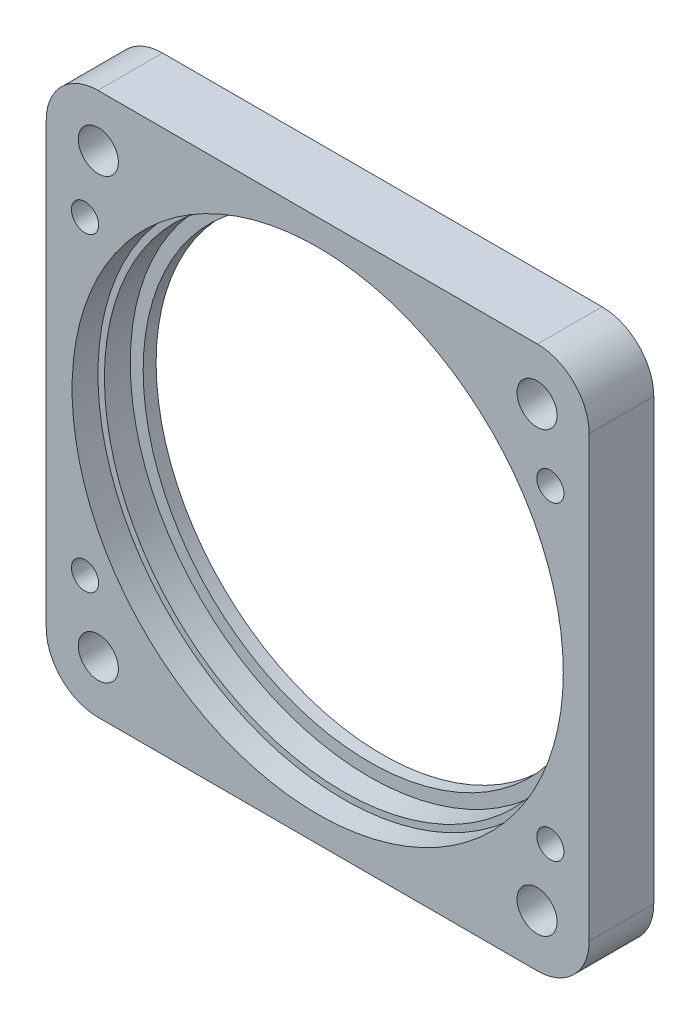
ISO-10303-21;
HEADER;
FILE_DESCRIPTION(('STEP AP214'),'2;1');
FILE_NAME('part.step','',(''),(''),'','','');
FILE_SCHEMA(('AUTOMOTIVE_DESIGN { 1 0 10303 214 1 1 1 1 }'));
ENDSEC;
DATA;
#1=APPLICATION_CONTEXT('core data for automotive mechanical design processes');
#2=APPLICATION_PROTOCOL_DEFINITION('international standard','automotive_design',2000,#1);
#3=PRODUCT_CONTEXT('',#1,'mechanical');
#4=PRODUCT('Part','Part','',(#3));
#5=PRODUCT_RELATED_PRODUCT_CATEGORY('part','',(#4));
#6=PRODUCT_DEFINITION_FORMATION('','',#4);
#7=PRODUCT_DEFINITION_CONTEXT('part definition',#1,'design');
#8=PRODUCT_DEFINITION('design','',#6,#7);
#9=PRODUCT_DEFINITION_SHAPE('','',#8);
#10=(LENGTH_UNIT() NAMED_UNIT(*) SI_UNIT(.MILLI.,.METRE.));
#11=(NAMED_UNIT(*) PLANE_ANGLE_UNIT() SI_UNIT($,.RADIAN.));
#12=(NAMED_UNIT(*) SI_UNIT($,.STERADIAN.) SOLID_ANGLE_UNIT());
#13=UNCERTAINTY_MEASURE_WITH_UNIT(LENGTH_MEASURE(1.E-05),#10,'distance_accuracy_value','');
#14=(GEOMETRIC_REPRESENTATION_CONTEXT(3) GLOBAL_UNCERTAINTY_ASSIGNED_CONTEXT((#13)) GLOBAL_UNIT_ASSIGNED_CONTEXT((#10,
#11,#12)) REPRESENTATION_CONTEXT('',''));
#15=CARTESIAN_POINT('',(0.,0.,0.));
#16=DIRECTION('',(0.,0.,1.));
#17=DIRECTION('',(1.,0.,0.));
#18=AXIS2_PLACEMENT_3D('',#15,#16,#17);
#19=CARTESIAN_POINT('',(18.,12.,5.));
#20=DIRECTION('',(0.,0.,-1.));
#21=DIRECTION('',(-1.,0.,0.));
#22=AXIS2_PLACEMENT_3D('',#19,#20,#21);
#23=CYLINDRICAL_SURFACE('',#22,1.05);
#24=CARTESIAN_POINT('',(18.,12.,5.));
#25=DIRECTION('',(0.,0.,-1.));
#26=DIRECTION('',(-1.,0.,0.));
#27=AXIS2_PLACEMENT_3D('',#24,#25,#26);
#28=CIRCLE('',#27,1.05);
#29=CARTESIAN_POINT('',(16.95,12.,5.));
#30=VERTEX_POINT('',#29);
#31=EDGE_CURVE('E199',#30,#30,#28,.T.);
#32=ORIENTED_EDGE('',*,*,#31,.F.);
#33=EDGE_LOOP('',(#32));
#34=FACE_BOUND('',#33,.T.);
#35=CARTESIAN_POINT('',(18.,12.,3.));
#36=DIRECTION('',(0.,0.,-1.));
#37=DIRECTION('',(-1.,0.,0.));
#38=AXIS2_PLACEMENT_3D('',#35,#36,#37);
#39=CIRCLE('',#38,1.05);
#40=CARTESIAN_POINT('',(16.95,12.,3.));
#41=VERTEX_POINT('',#40);
#42=EDGE_CURVE('E46',#41,#41,#39,.F.);
#43=ORIENTED_EDGE('',*,*,#42,.F.);
#44=EDGE_LOOP('',(#43));
#45=FACE_BOUND('',#44,.T.);
#46=ADVANCED_FACE('F42',(#34,#45),#23,.F.);
#47=CARTESIAN_POINT('',(-18.,-12.,5.));
#48=DIRECTION('',(0.,0.,-1.));
#49=DIRECTION('',(-1.,0.,0.));
#50=AXIS2_PLACEMENT_3D('',#47,#48,#49);
#51=CYLINDRICAL_SURFACE('',#50,1.05);
#52=CARTESIAN_POINT('',(-18.,-12.,5.));
#53=DIRECTION('',(0.,0.,-1.));
#54=DIRECTION('',(-1.,0.,0.));
#55=AXIS2_PLACEMENT_3D('',#52,#53,#54);
#56=CIRCLE('',#55,1.05);
#57=CARTESIAN_POINT('',(-19.05,-12.,5.));
#58=VERTEX_POINT('',#57);
#59=EDGE_CURVE('E190',#58,#58,#56,.T.);
#60=ORIENTED_EDGE('',*,*,#59,.F.);
#61=EDGE_LOOP('',(#60));
#62=FACE_BOUND('',#61,.T.);
#63=CARTESIAN_POINT('',(-18.,-12.,3.));
#64=DIRECTION('',(0.,0.,-1.));
#65=DIRECTION('',(-1.,0.,0.));
#66=AXIS2_PLACEMENT_3D('',#63,#64,#65);
#67=CIRCLE('',#66,1.05);
#68=CARTESIAN_POINT('',(-19.05,-12.,3.));
#69=VERTEX_POINT('',#68);
#70=EDGE_CURVE('E178',#69,#69,#67,.F.);
#71=ORIENTED_EDGE('',*,*,#70,.F.);
#72=EDGE_LOOP('',(#71));
#73=FACE_BOUND('',#72,.T.);
#74=ADVANCED_FACE('F262',(#62,#73),#51,.F.);
#75=CARTESIAN_POINT('',(0.,0.,-52.3259018078045));
#76=DIRECTION('',(0.,0.,1.));
#77=DIRECTION('',(1.,0.,0.));
#78=AXIS2_PLACEMENT_3D('',#75,#76,#77);
#79=CYLINDRICAL_SURFACE('',#78,18.5);
#80=CARTESIAN_POINT('',(0.,0.,1.));
#81=DIRECTION('',(0.,0.,1.));
#82=DIRECTION('',(1.,0.,0.));
#83=AXIS2_PLACEMENT_3D('',#80,#81,#82);
#84=CIRCLE('',#83,18.5);
#85=CARTESIAN_POINT('',(18.5,0.,1.));
#86=VERTEX_POINT('',#85);
#87=EDGE_CURVE('E149',#86,#86,#84,.F.);
#88=ORIENTED_EDGE('',*,*,#87,.T.);
#89=EDGE_LOOP('',(#88));
#90=FACE_BOUND('',#89,.T.);
#91=CARTESIAN_POINT('',(0.,0.,3.));
#92=DIRECTION('',(0.,0.,1.));
#93=DIRECTION('',(1.,0.,0.));
#94=AXIS2_PLACEMENT_3D('',#91,#92,#93);
#95=CIRCLE('',#94,18.5);
#96=CARTESIAN_POINT('',(18.5,0.,3.));
#97=VERTEX_POINT('',#96);
#98=EDGE_CURVE('E150',#97,#97,#95,.F.);
#99=ORIENTED_EDGE('',*,*,#98,.F.);
#100=EDGE_LOOP('',(#99));
#101=FACE_BOUND('',#100,.T.);
#102=ADVANCED_FACE('F268',(#90,#101),#79,.F.);
#103=CARTESIAN_POINT('',(0.,0.,0.));
#104=DIRECTION('',(0.,0.,1.));
#105=DIRECTION('',(1.,0.,0.));
#106=AXIS2_PLACEMENT_3D('',#103,#104,#105);
#107=CYLINDRICAL_SURFACE('',#106,17.5);
#108=CARTESIAN_POINT('',(0.,0.,0.));
#109=DIRECTION('',(0.,0.,1.));
#110=DIRECTION('',(1.,0.,0.));
#111=AXIS2_PLACEMENT_3D('',#108,#109,#110);
#112=CIRCLE('',#111,17.5);
#113=CARTESIAN_POINT('',(17.5,0.,0.));
#114=VERTEX_POINT('',#113);
#115=EDGE_CURVE('E148',#114,#114,#112,.T.);
#116=ORIENTED_EDGE('',*,*,#115,.F.);
#117=EDGE_LOOP('',(#116));
#118=FACE_BOUND('',#117,.T.);
#119=CARTESIAN_POINT('',(0.,0.,1.));
#120=DIRECTION('',(0.,0.,1.));
#121=DIRECTION('',(1.,0.,0.));
#122=AXIS2_PLACEMENT_3D('',#119,#120,#121);
#123=CIRCLE('',#122,17.5);
#124=CARTESIAN_POINT('',(17.5,0.,1.));
#125=VERTEX_POINT('',#124);
#126=EDGE_CURVE('E145',#125,#125,#123,.F.);
#127=ORIENTED_EDGE('',*,*,#126,.F.);
#128=EDGE_LOOP('',(#127));
#129=FACE_BOUND('',#128,.T.);
#130=ADVANCED_FACE('F307',(#118,#129),#107,.F.);
#131=CARTESIAN_POINT('',(21.,21.,5.));
#132=DIRECTION('',(-1.,0.,0.));
#133=DIRECTION('',(0.,-1.,0.));
#134=AXIS2_PLACEMENT_3D('',#131,#132,#133);
#135=PLANE('',#134);
#136=DIRECTION('',(0.,1.,0.));
#137=VECTOR('',#136,1.);
#138=CARTESIAN_POINT('',(21.,21.,5.));
#139=LINE('',#138,#137);
#140=CARTESIAN_POINT('',(21.,-17.,5.));
#141=VERTEX_POINT('',#140);
#142=CARTESIAN_POINT('',(21.,17.,5.));
#143=VERTEX_POINT('',#142);
#144=EDGE_CURVE('E136',#141,#143,#139,.T.);
#145=ORIENTED_EDGE('',*,*,#144,.F.);
#146=DIRECTION('',(0.,0.,-1.));
#147=VECTOR('',#146,1.);
#148=CARTESIAN_POINT('',(21.,-17.,5.));
#149=LINE('',#148,#147);
#150=CARTESIAN_POINT('',(21.,-17.,0.));
#151=VERTEX_POINT('',#150);
#152=EDGE_CURVE('E171',#141,#151,#149,.T.);
#153=ORIENTED_EDGE('',*,*,#152,.T.);
#154=DIRECTION('',(0.,1.,0.));
#155=VECTOR('',#154,1.);
#156=CARTESIAN_POINT('',(21.,21.,0.));
#157=LINE('',#156,#155);
#158=CARTESIAN_POINT('',(21.,17.,0.));
#159=VERTEX_POINT('',#158);
#160=EDGE_CURVE('E234',#151,#159,#157,.T.);
#161=ORIENTED_EDGE('',*,*,#160,.T.);
#162=DIRECTION('',(0.,0.,-1.));
#163=VECTOR('',#162,1.);
#164=CARTESIAN_POINT('',(21.,17.,5.));
#165=LINE('',#164,#163);
#166=EDGE_CURVE('E169',#159,#143,#165,.F.);
#167=ORIENTED_EDGE('',*,*,#166,.T.);
#168=EDGE_LOOP('',(#145,#153,#161,#167));
#169=FACE_BOUND('',#168,.T.);
#170=ADVANCED_FACE('F259',(#169),#135,.F.);
#171=CARTESIAN_POINT('',(-21.,21.,5.));
#172=DIRECTION('',(0.,-1.,0.));
#173=DIRECTION('',(0.,0.,-1.));
#174=AXIS2_PLACEMENT_3D('',#171,#172,#173);
#175=PLANE('',#174);
#176=DIRECTION('',(-1.,0.,0.));
#177=VECTOR('',#176,1.);
#178=CARTESIAN_POINT('',(-21.,21.,5.));
#179=LINE('',#178,#177);
#180=CARTESIAN_POINT('',(17.,21.,5.));
#181=VERTEX_POINT('',#180);
#182=CARTESIAN_POINT('',(-17.,21.,5.));
#183=VERTEX_POINT('',#182);
#184=EDGE_CURVE('E139',#181,#183,#179,.T.);
#185=ORIENTED_EDGE('',*,*,#184,.F.);
#186=DIRECTION('',(0.,0.,-1.));
#187=VECTOR('',#186,1.);
#188=CARTESIAN_POINT('',(17.,21.,5.));
#189=LINE('',#188,#187);
#190=CARTESIAN_POINT('',(17.,21.,0.));
#191=VERTEX_POINT('',#190);
#192=EDGE_CURVE('E13',#181,#191,#189,.T.);
#193=ORIENTED_EDGE('',*,*,#192,.T.);
#194=DIRECTION('',(-1.,0.,0.));
#195=VECTOR('',#194,1.);
#196=CARTESIAN_POINT('',(-21.,21.,0.));
#197=LINE('',#196,#195);
#198=CARTESIAN_POINT('',(-17.,21.,0.));
#199=VERTEX_POINT('',#198);
#200=EDGE_CURVE('E141',#191,#199,#197,.T.);
#201=ORIENTED_EDGE('',*,*,#200,.T.);
#202=DIRECTION('',(0.,0.,-1.));
#203=VECTOR('',#202,1.);
#204=CARTESIAN_POINT('',(-17.,21.,5.));
#205=LINE('',#204,#203);
#206=EDGE_CURVE('E51',#199,#183,#205,.F.);
#207=ORIENTED_EDGE('',*,*,#206,.T.);
#208=EDGE_LOOP('',(#185,#193,#201,#207));
#209=FACE_BOUND('',#208,.T.);
#210=ADVANCED_FACE('F243',(#209),#175,.F.);
#211=CARTESIAN_POINT('',(-21.,21.,5.));
#212=DIRECTION('',(1.,0.,0.));
#213=DIRECTION('',(0.,0.,-1.));
#214=AXIS2_PLACEMENT_3D('',#211,#212,#213);
#215=PLANE('',#214);
#216=DIRECTION('',(0.,-1.,0.));
#217=VECTOR('',#216,1.);
#218=CARTESIAN_POINT('',(-21.,21.,0.));
#219=LINE('',#218,#217);
#220=CARTESIAN_POINT('',(-21.,17.,0.));
#221=VERTEX_POINT('',#220);
#222=CARTESIAN_POINT('',(-21.,-17.,0.));
#223=VERTEX_POINT('',#222);
#224=EDGE_CURVE('E137',#221,#223,#219,.T.);
#225=ORIENTED_EDGE('',*,*,#224,.T.);
#226=DIRECTION('',(0.,0.,-1.));
#227=VECTOR('',#226,1.);
#228=CARTESIAN_POINT('',(-21.,-17.,5.));
#229=LINE('',#228,#227);
#230=CARTESIAN_POINT('',(-21.,-17.,5.));
#231=VERTEX_POINT('',#230);
#232=EDGE_CURVE('E115',#223,#231,#229,.F.);
#233=ORIENTED_EDGE('',*,*,#232,.T.);
#234=DIRECTION('',(0.,-1.,0.));
#235=VECTOR('',#234,1.);
#236=CARTESIAN_POINT('',(-21.,21.,5.));
#237=LINE('',#236,#235);
#238=CARTESIAN_POINT('',(-21.,17.,5.));
#239=VERTEX_POINT('',#238);
#240=EDGE_CURVE('E237',#239,#231,#237,.T.);
#241=ORIENTED_EDGE('',*,*,#240,.F.);
#242=DIRECTION('',(0.,0.,-1.));
#243=VECTOR('',#242,1.);
#244=CARTESIAN_POINT('',(-21.,17.,5.));
#245=LINE('',#244,#243);
#246=EDGE_CURVE('E120',#239,#221,#245,.T.);
#247=ORIENTED_EDGE('',*,*,#246,.T.);
#248=EDGE_LOOP('',(#225,#233,#241,#247));
#249=FACE_BOUND('',#248,.T.);
#250=ADVANCED_FACE('F251',(#249),#215,.F.);
#251=CARTESIAN_POINT('',(-21.,-21.,5.));
#252=DIRECTION('',(0.,1.,0.));
#253=DIRECTION('',(0.,0.,1.));
#254=AXIS2_PLACEMENT_3D('',#251,#252,#253);
#255=PLANE('',#254);
#256=DIRECTION('',(1.,0.,0.));
#257=VECTOR('',#256,1.);
#258=CARTESIAN_POINT('',(-21.,-21.,5.));
#259=LINE('',#258,#257);
#260=CARTESIAN_POINT('',(-17.,-21.,5.));
#261=VERTEX_POINT('',#260);
#262=CARTESIAN_POINT('',(17.,-21.,5.));
#263=VERTEX_POINT('',#262);
#264=EDGE_CURVE('E130',#261,#263,#259,.T.);
#265=ORIENTED_EDGE('',*,*,#264,.F.);
#266=DIRECTION('',(0.,0.,-1.));
#267=VECTOR('',#266,1.);
#268=CARTESIAN_POINT('',(-17.,-21.,5.));
#269=LINE('',#268,#267);
#270=CARTESIAN_POINT('',(-17.,-21.,0.));
#271=VERTEX_POINT('',#270);
#272=EDGE_CURVE('E114',#261,#271,#269,.T.);
#273=ORIENTED_EDGE('',*,*,#272,.T.);
#274=DIRECTION('',(1.,0.,0.));
#275=VECTOR('',#274,1.);
#276=CARTESIAN_POINT('',(-21.,-21.,0.));
#277=LINE('',#276,#275);
#278=CARTESIAN_POINT('',(17.,-21.,0.));
#279=VERTEX_POINT('',#278);
#280=EDGE_CURVE('E127',#271,#279,#277,.T.);
#281=ORIENTED_EDGE('',*,*,#280,.T.);
#282=DIRECTION('',(0.,0.,-1.));
#283=VECTOR('',#282,1.);
#284=CARTESIAN_POINT('',(17.,-21.,5.));
#285=LINE('',#284,#283);
#286=EDGE_CURVE('E132',#279,#263,#285,.F.);
#287=ORIENTED_EDGE('',*,*,#286,.T.);
#288=EDGE_LOOP('',(#265,#273,#281,#287));
#289=FACE_BOUND('',#288,.T.);
#290=ADVANCED_FACE('F126',(#289),#255,.F.);
#291=CARTESIAN_POINT('',(0.,0.,5.));
#292=DIRECTION('',(0.,0.,1.));
#293=DIRECTION('',(1.,0.,0.));
#294=AXIS2_PLACEMENT_3D('',#291,#292,#293);
#295=PLANE('',#294);
#296=CARTESIAN_POINT('',(18.,-12.,5.));
#297=DIRECTION('',(0.,0.,-1.));
#298=DIRECTION('',(1.,0.,0.));
#299=AXIS2_PLACEMENT_3D('',#296,#297,#298);
#300=CIRCLE('',#299,1.05);
#301=CARTESIAN_POINT('',(19.05,-12.,5.));
#302=VERTEX_POINT('',#301);
#303=EDGE_CURVE('E186',#302,#302,#300,.T.);
#304=ORIENTED_EDGE('',*,*,#303,.T.);
#305=EDGE_LOOP('',(#304));
#306=FACE_BOUND('',#305,.T.);
#307=ORIENTED_EDGE('',*,*,#59,.T.);
#308=EDGE_LOOP('',(#307));
#309=FACE_BOUND('',#308,.T.);
#310=CARTESIAN_POINT('',(-18.,12.,5.));
#311=DIRECTION('',(0.,0.,-1.));
#312=DIRECTION('',(1.,0.,0.));
#313=AXIS2_PLACEMENT_3D('',#310,#311,#312);
#314=CIRCLE('',#313,1.05);
#315=CARTESIAN_POINT('',(-16.95,12.,5.));
#316=VERTEX_POINT('',#315);
#317=EDGE_CURVE('E195',#316,#316,#314,.T.);
#318=ORIENTED_EDGE('',*,*,#317,.T.);
#319=EDGE_LOOP('',(#318));
#320=FACE_BOUND('',#319,.T.);
#321=ORIENTED_EDGE('',*,*,#31,.T.);
#322=EDGE_LOOP('',(#321));
#323=FACE_BOUND('',#322,.T.);
#324=CARTESIAN_POINT('',(-16.9705627484768,-16.9705627484768,5.));
#325=DIRECTION('',(0.,0.,1.));
#326=DIRECTION('',(1.,0.,0.));
#327=AXIS2_PLACEMENT_3D('',#324,#325,#326);
#328=CIRCLE('',#327,1.55);
#329=CARTESIAN_POINT('',(-15.4205627484768,-16.9705627484768,5.));
#330=VERTEX_POINT('',#329);
#331=EDGE_CURVE('E216',#330,#330,#328,.T.);
#332=ORIENTED_EDGE('',*,*,#331,.F.);
#333=EDGE_LOOP('',(#332));
#334=FACE_BOUND('',#333,.T.);
#335=CARTESIAN_POINT('',(16.9705627484774,-16.9705627484768,5.));
#336=DIRECTION('',(0.,0.,1.));
#337=DIRECTION('',(1.,0.,0.));
#338=AXIS2_PLACEMENT_3D('',#335,#336,#337);
#339=CIRCLE('',#338,1.55);
#340=CARTESIAN_POINT('',(18.5205627484774,-16.9705627484768,5.));
#341=VERTEX_POINT('',#340);
#342=EDGE_CURVE('E210',#341,#341,#339,.T.);
#343=ORIENTED_EDGE('',*,*,#342,.F.);
#344=EDGE_LOOP('',(#343));
#345=FACE_BOUND('',#344,.T.);
#346=CARTESIAN_POINT('',(16.9705627484775,16.9705627484774,5.));
#347=DIRECTION('',(0.,0.,1.));
#348=DIRECTION('',(1.,0.,0.));
#349=AXIS2_PLACEMENT_3D('',#346,#347,#348);
#350=CIRCLE('',#349,1.55);
#351=CARTESIAN_POINT('',(18.5205627484775,16.9705627484774,5.));
#352=VERTEX_POINT('',#351);
#353=EDGE_CURVE('E203',#352,#352,#350,.T.);
#354=ORIENTED_EDGE('',*,*,#353,.F.);
#355=EDGE_LOOP('',(#354));
#356=FACE_BOUND('',#355,.T.);
#357=CARTESIAN_POINT('',(-16.9705627484768,16.9705627484775,5.));
#358=DIRECTION('',(0.,0.,1.));
#359=DIRECTION('',(1.,0.,0.));
#360=AXIS2_PLACEMENT_3D('',#357,#358,#359);
#361=CIRCLE('',#360,1.55);
#362=CARTESIAN_POINT('',(-15.4205627484768,16.9705627484775,5.));
#363=VERTEX_POINT('',#362);
#364=EDGE_CURVE('E206',#363,#363,#361,.T.);
#365=ORIENTED_EDGE('',*,*,#364,.F.);
#366=EDGE_LOOP('',(#365));
#367=FACE_BOUND('',#366,.T.);
#368=CARTESIAN_POINT('',(0.,0.,5.));
#369=DIRECTION('',(0.,0.,1.));
#370=DIRECTION('',(1.,0.,0.));
#371=AXIS2_PLACEMENT_3D('',#368,#369,#370);
#372=CIRCLE('',#371,19.);
#373=CARTESIAN_POINT('',(19.,0.,5.));
#374=VERTEX_POINT('',#373);
#375=EDGE_CURVE('E224',#374,#374,#372,.T.);
#376=ORIENTED_EDGE('',*,*,#375,.F.);
#377=EDGE_LOOP('',(#376));
#378=FACE_BOUND('',#377,.T.);
#379=ORIENTED_EDGE('',*,*,#240,.T.);
#380=CARTESIAN_POINT('',(-17.,-17.,5.));
#381=DIRECTION('',(0.,0.,1.));
#382=DIRECTION('',(1.,0.,0.));
#383=AXIS2_PLACEMENT_3D('',#380,#381,#382);
#384=CIRCLE('',#383,4.);
#385=EDGE_CURVE('E167',#231,#261,#384,.T.);
#386=ORIENTED_EDGE('',*,*,#385,.T.);
#387=ORIENTED_EDGE('',*,*,#264,.T.);
#388=CARTESIAN_POINT('',(17.,-17.,5.));
#389=DIRECTION('',(0.,0.,1.));
#390=DIRECTION('',(1.,0.,0.));
#391=AXIS2_PLACEMENT_3D('',#388,#389,#390);
#392=CIRCLE('',#391,4.);
#393=EDGE_CURVE('E165',#263,#141,#392,.T.);
#394=ORIENTED_EDGE('',*,*,#393,.T.);
#395=ORIENTED_EDGE('',*,*,#144,.T.);
#396=CARTESIAN_POINT('',(17.,17.,5.));
#397=DIRECTION('',(0.,0.,1.));
#398=DIRECTION('',(1.,0.,0.));
#399=AXIS2_PLACEMENT_3D('',#396,#397,#398);
#400=CIRCLE('',#399,4.);
#401=EDGE_CURVE('E65',#143,#181,#400,.T.);
#402=ORIENTED_EDGE('',*,*,#401,.T.);
#403=ORIENTED_EDGE('',*,*,#184,.T.);
#404=CARTESIAN_POINT('',(-17.,17.,5.));
#405=DIRECTION('',(0.,0.,1.));
#406=DIRECTION('',(1.,0.,0.));
#407=AXIS2_PLACEMENT_3D('',#404,#405,#406);
#408=CIRCLE('',#407,4.);
#409=EDGE_CURVE('E162',#183,#239,#408,.T.);
#410=ORIENTED_EDGE('',*,*,#409,.T.);
#411=EDGE_LOOP('',(#379,#386,#387,#394,#395,#402,#403,#410));
#412=FACE_BOUND('',#411,.T.);
#413=ADVANCED_FACE('F249',(#306,#309,#320,#323,#334,#345,#356,#367,#378,#412),#295,.T.);
#414=CARTESIAN_POINT('',(0.,0.,0.));
#415=DIRECTION('',(0.,0.,1.));
#416=DIRECTION('',(1.,0.,0.));
#417=AXIS2_PLACEMENT_3D('',#414,#415,#416);
#418=PLANE('',#417);
#419=CARTESIAN_POINT('',(18.,-12.,0.));
#420=DIRECTION('',(0.,0.,-1.));
#421=DIRECTION('',(1.,0.,0.));
#422=AXIS2_PLACEMENT_3D('',#419,#420,#421);
#423=CIRCLE('',#422,2.);
#424=CARTESIAN_POINT('',(20.,-12.,0.));
#425=VERTEX_POINT('',#424);
#426=EDGE_CURVE('E321',#425,#425,#423,.T.);
#427=ORIENTED_EDGE('',*,*,#426,.F.);
#428=EDGE_LOOP('',(#427));
#429=FACE_BOUND('',#428,.T.);
#430=CARTESIAN_POINT('',(-18.,-12.,0.));
#431=DIRECTION('',(0.,0.,-1.));
#432=DIRECTION('',(-1.,0.,0.));
#433=AXIS2_PLACEMENT_3D('',#430,#431,#432);
#434=CIRCLE('',#433,2.);
#435=CARTESIAN_POINT('',(-20.,-12.,0.));
#436=VERTEX_POINT('',#435);
#437=EDGE_CURVE('E325',#436,#436,#434,.T.);
#438=ORIENTED_EDGE('',*,*,#437,.F.);
#439=EDGE_LOOP('',(#438));
#440=FACE_BOUND('',#439,.T.);
#441=CARTESIAN_POINT('',(-18.,12.,0.));
#442=DIRECTION('',(0.,0.,-1.));
#443=DIRECTION('',(1.,0.,0.));
#444=AXIS2_PLACEMENT_3D('',#441,#442,#443);
#445=CIRCLE('',#444,2.);
#446=CARTESIAN_POINT('',(-16.,12.,0.));
#447=VERTEX_POINT('',#446);
#448=EDGE_CURVE('E329',#447,#447,#445,.T.);
#449=ORIENTED_EDGE('',*,*,#448,.F.);
#450=EDGE_LOOP('',(#449));
#451=FACE_BOUND('',#450,.T.);
#452=CARTESIAN_POINT('',(18.,12.,0.));
#453=DIRECTION('',(0.,0.,-1.));
#454=DIRECTION('',(-1.,0.,0.));
#455=AXIS2_PLACEMENT_3D('',#452,#453,#454);
#456=CIRCLE('',#455,2.);
#457=CARTESIAN_POINT('',(16.,12.,0.));
#458=VERTEX_POINT('',#457);
#459=EDGE_CURVE('E333',#458,#458,#456,.T.);
#460=ORIENTED_EDGE('',*,*,#459,.F.);
#461=EDGE_LOOP('',(#460));
#462=FACE_BOUND('',#461,.T.);
#463=CARTESIAN_POINT('',(-16.9705627484768,-16.9705627484768,0.));
#464=DIRECTION('',(0.,0.,1.));
#465=DIRECTION('',(1.,0.,0.));
#466=AXIS2_PLACEMENT_3D('',#463,#464,#465);
#467=CIRCLE('',#466,1.55);
#468=CARTESIAN_POINT('',(-15.4205627484768,-16.9705627484768,0.));
#469=VERTEX_POINT('',#468);
#470=EDGE_CURVE('E202',#469,#469,#467,.T.);
#471=ORIENTED_EDGE('',*,*,#470,.T.);
#472=EDGE_LOOP('',(#471));
#473=FACE_BOUND('',#472,.T.);
#474=CARTESIAN_POINT('',(16.9705627484774,-16.9705627484768,0.));
#475=DIRECTION('',(0.,0.,1.));
#476=DIRECTION('',(1.,0.,0.));
#477=AXIS2_PLACEMENT_3D('',#474,#475,#476);
#478=CIRCLE('',#477,1.55);
#479=CARTESIAN_POINT('',(18.5205627484774,-16.9705627484768,0.));
#480=VERTEX_POINT('',#479);
#481=EDGE_CURVE('E213',#480,#480,#478,.T.);
#482=ORIENTED_EDGE('',*,*,#481,.T.);
#483=EDGE_LOOP('',(#482));
#484=FACE_BOUND('',#483,.T.);
#485=CARTESIAN_POINT('',(16.9705627484775,16.9705627484774,0.));
#486=DIRECTION('',(0.,0.,1.));
#487=DIRECTION('',(1.,0.,0.));
#488=AXIS2_PLACEMENT_3D('',#485,#486,#487);
#489=CIRCLE('',#488,1.55);
#490=CARTESIAN_POINT('',(18.5205627484775,16.9705627484774,0.));
#491=VERTEX_POINT('',#490);
#492=EDGE_CURVE('E207',#491,#491,#489,.T.);
#493=ORIENTED_EDGE('',*,*,#492,.T.);
#494=EDGE_LOOP('',(#493));
#495=FACE_BOUND('',#494,.T.);
#496=CARTESIAN_POINT('',(-16.9705627484768,16.9705627484775,0.));
#497=DIRECTION('',(0.,0.,1.));
#498=DIRECTION('',(1.,0.,0.));
#499=AXIS2_PLACEMENT_3D('',#496,#497,#498);
#500=CIRCLE('',#499,1.55);
#501=CARTESIAN_POINT('',(-15.4205627484768,16.9705627484775,0.));
#502=VERTEX_POINT('',#501);
#503=EDGE_CURVE('E221',#502,#502,#500,.T.);
#504=ORIENTED_EDGE('',*,*,#503,.T.);
#505=EDGE_LOOP('',(#504));
#506=FACE_BOUND('',#505,.T.);
#507=ORIENTED_EDGE('',*,*,#115,.T.);
#508=EDGE_LOOP('',(#507));
#509=FACE_BOUND('',#508,.T.);
#510=ORIENTED_EDGE('',*,*,#280,.F.);
#511=CARTESIAN_POINT('',(-17.,-17.,0.));
#512=DIRECTION('',(0.,0.,1.));
#513=DIRECTION('',(1.,0.,0.));
#514=AXIS2_PLACEMENT_3D('',#511,#512,#513);
#515=CIRCLE('',#514,4.);
#516=EDGE_CURVE('E110',#271,#223,#515,.F.);
#517=ORIENTED_EDGE('',*,*,#516,.T.);
#518=ORIENTED_EDGE('',*,*,#224,.F.);
#519=CARTESIAN_POINT('',(-17.,17.,0.));
#520=DIRECTION('',(0.,0.,1.));
#521=DIRECTION('',(1.,0.,0.));
#522=AXIS2_PLACEMENT_3D('',#519,#520,#521);
#523=CIRCLE('',#522,4.);
#524=EDGE_CURVE('E131',#221,#199,#523,.F.);
#525=ORIENTED_EDGE('',*,*,#524,.T.);
#526=ORIENTED_EDGE('',*,*,#200,.F.);
#527=CARTESIAN_POINT('',(17.,17.,0.));
#528=DIRECTION('',(0.,0.,1.));
#529=DIRECTION('',(1.,0.,0.));
#530=AXIS2_PLACEMENT_3D('',#527,#528,#529);
#531=CIRCLE('',#530,4.);
#532=EDGE_CURVE('E156',#191,#159,#531,.F.);
#533=ORIENTED_EDGE('',*,*,#532,.T.);
#534=ORIENTED_EDGE('',*,*,#160,.F.);
#535=CARTESIAN_POINT('',(17.,-17.,0.));
#536=DIRECTION('',(0.,0.,1.));
#537=DIRECTION('',(1.,0.,0.));
#538=AXIS2_PLACEMENT_3D('',#535,#536,#537);
#539=CIRCLE('',#538,4.);
#540=EDGE_CURVE('E121',#151,#279,#539,.F.);
#541=ORIENTED_EDGE('',*,*,#540,.T.);
#542=EDGE_LOOP('',(#510,#517,#518,#525,#526,#533,#534,#541));
#543=FACE_BOUND('',#542,.T.);
#544=ADVANCED_FACE('F134',(#429,#440,#451,#462,#473,#484,#495,#506,#509,#543),#418,.F.);
#545=CARTESIAN_POINT('',(0.,0.,1.));
#546=DIRECTION('',(0.,0.,1.));
#547=DIRECTION('',(1.,0.,0.));
#548=AXIS2_PLACEMENT_3D('',#545,#546,#547);
#549=PLANE('',#548);
#550=ORIENTED_EDGE('',*,*,#87,.F.);
#551=EDGE_LOOP('',(#550));
#552=FACE_BOUND('',#551,.T.);
#553=ORIENTED_EDGE('',*,*,#126,.T.);
#554=EDGE_LOOP('',(#553));
#555=FACE_BOUND('',#554,.T.);
#556=ADVANCED_FACE('F297',(#552,#555),#549,.T.);
#557=CARTESIAN_POINT('',(0.,0.,3.));
#558=DIRECTION('',(0.,0.,1.));
#559=DIRECTION('',(1.,0.,0.));
#560=AXIS2_PLACEMENT_3D('',#557,#558,#559);
#561=PLANE('',#560);
#562=CARTESIAN_POINT('',(0.,0.,3.));
#563=DIRECTION('',(0.,0.,1.));
#564=DIRECTION('',(1.,0.,0.));
#565=AXIS2_PLACEMENT_3D('',#562,#563,#564);
#566=CIRCLE('',#565,19.);
#567=CARTESIAN_POINT('',(19.,0.,3.));
#568=VERTEX_POINT('',#567);
#569=EDGE_CURVE('E153',#568,#568,#566,.F.);
#570=ORIENTED_EDGE('',*,*,#569,.F.);
#571=EDGE_LOOP('',(#570));
#572=FACE_BOUND('',#571,.T.);
#573=ORIENTED_EDGE('',*,*,#98,.T.);
#574=EDGE_LOOP('',(#573));
#575=FACE_BOUND('',#574,.T.);
#576=ADVANCED_FACE('F293',(#572,#575),#561,.T.);
#577=CARTESIAN_POINT('',(0.,0.,-52.7401153701776));
#578=DIRECTION('',(0.,0.,1.));
#579=DIRECTION('',(1.,0.,0.));
#580=AXIS2_PLACEMENT_3D('',#577,#578,#579);
#581=CYLINDRICAL_SURFACE('',#580,19.);
#582=ORIENTED_EDGE('',*,*,#569,.T.);
#583=EDGE_LOOP('',(#582));
#584=FACE_BOUND('',#583,.T.);
#585=ORIENTED_EDGE('',*,*,#375,.T.);
#586=EDGE_LOOP('',(#585));
#587=FACE_BOUND('',#586,.T.);
#588=ADVANCED_FACE('F296',(#584,#587),#581,.F.);
#589=CARTESIAN_POINT('',(-17.,-17.,5.));
#590=DIRECTION('',(0.,0.,-1.));
#591=DIRECTION('',(-1.,0.,0.));
#592=AXIS2_PLACEMENT_3D('',#589,#590,#591);
#593=CYLINDRICAL_SURFACE('',#592,4.);
#594=ORIENTED_EDGE('',*,*,#385,.F.);
#595=ORIENTED_EDGE('',*,*,#232,.F.);
#596=ORIENTED_EDGE('',*,*,#516,.F.);
#597=ORIENTED_EDGE('',*,*,#272,.F.);
#598=EDGE_LOOP('',(#594,#595,#596,#597));
#599=FACE_BOUND('',#598,.T.);
#600=ADVANCED_FACE('F113',(#599),#593,.T.);
#601=CARTESIAN_POINT('',(17.,-17.,5.));
#602=DIRECTION('',(0.,0.,-1.));
#603=DIRECTION('',(-1.,0.,0.));
#604=AXIS2_PLACEMENT_3D('',#601,#602,#603);
#605=CYLINDRICAL_SURFACE('',#604,4.);
#606=ORIENTED_EDGE('',*,*,#393,.F.);
#607=ORIENTED_EDGE('',*,*,#286,.F.);
#608=ORIENTED_EDGE('',*,*,#540,.F.);
#609=ORIENTED_EDGE('',*,*,#152,.F.);
#610=EDGE_LOOP('',(#606,#607,#608,#609));
#611=FACE_BOUND('',#610,.T.);
#612=ADVANCED_FACE('F562',(#611),#605,.T.);
#613=CARTESIAN_POINT('',(17.,17.,5.));
#614=DIRECTION('',(0.,0.,-1.));
#615=DIRECTION('',(-1.,0.,0.));
#616=AXIS2_PLACEMENT_3D('',#613,#614,#615);
#617=CYLINDRICAL_SURFACE('',#616,4.);
#618=ORIENTED_EDGE('',*,*,#401,.F.);
#619=ORIENTED_EDGE('',*,*,#166,.F.);
#620=ORIENTED_EDGE('',*,*,#532,.F.);
#621=ORIENTED_EDGE('',*,*,#192,.F.);
#622=EDGE_LOOP('',(#618,#619,#620,#621));
#623=FACE_BOUND('',#622,.T.);
#624=ADVANCED_FACE('F553',(#623),#617,.T.);
#625=CARTESIAN_POINT('',(-17.,17.,5.));
#626=DIRECTION('',(0.,0.,-1.));
#627=DIRECTION('',(-1.,0.,0.));
#628=AXIS2_PLACEMENT_3D('',#625,#626,#627);
#629=CYLINDRICAL_SURFACE('',#628,4.);
#630=ORIENTED_EDGE('',*,*,#409,.F.);
#631=ORIENTED_EDGE('',*,*,#206,.F.);
#632=ORIENTED_EDGE('',*,*,#524,.F.);
#633=ORIENTED_EDGE('',*,*,#246,.F.);
#634=EDGE_LOOP('',(#630,#631,#632,#633));
#635=FACE_BOUND('',#634,.T.);
#636=ADVANCED_FACE('F44',(#635),#629,.T.);
#637=CARTESIAN_POINT('',(-16.9705627484768,16.9705627484775,0.));
#638=DIRECTION('',(0.,0.,1.));
#639=DIRECTION('',(1.,0.,0.));
#640=AXIS2_PLACEMENT_3D('',#637,#638,#639);
#641=CYLINDRICAL_SURFACE('',#640,1.55);
#642=ORIENTED_EDGE('',*,*,#503,.F.);
#643=EDGE_LOOP('',(#642));
#644=FACE_BOUND('',#643,.T.);
#645=ORIENTED_EDGE('',*,*,#364,.T.);
#646=EDGE_LOOP('',(#645));
#647=FACE_BOUND('',#646,.T.);
#648=ADVANCED_FACE('F280',(#644,#647),#641,.F.);
#649=CARTESIAN_POINT('',(16.9705627484775,16.9705627484774,0.));
#650=DIRECTION('',(0.,0.,1.));
#651=DIRECTION('',(1.,0.,0.));
#652=AXIS2_PLACEMENT_3D('',#649,#650,#651);
#653=CYLINDRICAL_SURFACE('',#652,1.55);
#654=ORIENTED_EDGE('',*,*,#492,.F.);
#655=EDGE_LOOP('',(#654));
#656=FACE_BOUND('',#655,.T.);
#657=ORIENTED_EDGE('',*,*,#353,.T.);
#658=EDGE_LOOP('',(#657));
#659=FACE_BOUND('',#658,.T.);
#660=ADVANCED_FACE('F276',(#656,#659),#653,.F.);
#661=CARTESIAN_POINT('',(16.9705627484774,-16.9705627484768,0.));
#662=DIRECTION('',(0.,0.,1.));
#663=DIRECTION('',(1.,0.,0.));
#664=AXIS2_PLACEMENT_3D('',#661,#662,#663);
#665=CYLINDRICAL_SURFACE('',#664,1.55);
#666=ORIENTED_EDGE('',*,*,#481,.F.);
#667=EDGE_LOOP('',(#666));
#668=FACE_BOUND('',#667,.T.);
#669=ORIENTED_EDGE('',*,*,#342,.T.);
#670=EDGE_LOOP('',(#669));
#671=FACE_BOUND('',#670,.T.);
#672=ADVANCED_FACE('F279',(#668,#671),#665,.F.);
#673=CARTESIAN_POINT('',(-16.9705627484768,-16.9705627484768,0.));
#674=DIRECTION('',(0.,0.,1.));
#675=DIRECTION('',(1.,0.,0.));
#676=AXIS2_PLACEMENT_3D('',#673,#674,#675);
#677=CYLINDRICAL_SURFACE('',#676,1.55);
#678=ORIENTED_EDGE('',*,*,#470,.F.);
#679=EDGE_LOOP('',(#678));
#680=FACE_BOUND('',#679,.T.);
#681=ORIENTED_EDGE('',*,*,#331,.T.);
#682=EDGE_LOOP('',(#681));
#683=FACE_BOUND('',#682,.T.);
#684=ADVANCED_FACE('F284',(#680,#683),#677,.F.);
#685=CARTESIAN_POINT('',(-18.,12.,5.));
#686=DIRECTION('',(0.,0.,-1.));
#687=DIRECTION('',(-1.,0.,0.));
#688=AXIS2_PLACEMENT_3D('',#685,#686,#687);
#689=CYLINDRICAL_SURFACE('',#688,1.05);
#690=CARTESIAN_POINT('',(-18.,12.,3.));
#691=DIRECTION('',(0.,0.,1.));
#692=DIRECTION('',(1.,0.,0.));
#693=AXIS2_PLACEMENT_3D('',#690,#691,#692);
#694=CIRCLE('',#693,1.05);
#695=CARTESIAN_POINT('',(-16.95,12.,3.));
#696=VERTEX_POINT('',#695);
#697=EDGE_CURVE('E181',#696,#696,#694,.F.);
#698=ORIENTED_EDGE('',*,*,#697,.T.);
#699=EDGE_LOOP('',(#698));
#700=FACE_BOUND('',#699,.T.);
#701=ORIENTED_EDGE('',*,*,#317,.F.);
#702=EDGE_LOOP('',(#701));
#703=FACE_BOUND('',#702,.T.);
#704=ADVANCED_FACE('F288',(#700,#703),#689,.F.);
#705=CARTESIAN_POINT('',(18.,-12.,5.));
#706=DIRECTION('',(0.,0.,-1.));
#707=DIRECTION('',(-1.,0.,0.));
#708=AXIS2_PLACEMENT_3D('',#705,#706,#707);
#709=CYLINDRICAL_SURFACE('',#708,1.05);
#710=CARTESIAN_POINT('',(18.,-12.,3.));
#711=DIRECTION('',(0.,0.,1.));
#712=DIRECTION('',(1.,0.,0.));
#713=AXIS2_PLACEMENT_3D('',#710,#711,#712);
#714=CIRCLE('',#713,1.05);
#715=CARTESIAN_POINT('',(19.05,-12.,3.));
#716=VERTEX_POINT('',#715);
#717=EDGE_CURVE('E175',#716,#716,#714,.F.);
#718=ORIENTED_EDGE('',*,*,#717,.T.);
#719=EDGE_LOOP('',(#718));
#720=FACE_BOUND('',#719,.T.);
#721=ORIENTED_EDGE('',*,*,#303,.F.);
#722=EDGE_LOOP('',(#721));
#723=FACE_BOUND('',#722,.T.);
#724=ADVANCED_FACE('F275',(#720,#723),#709,.F.);
#725=CARTESIAN_POINT('',(18.,-12.,3.));
#726=DIRECTION('',(0.,0.,1.));
#727=DIRECTION('',(1.,0.,0.));
#728=AXIS2_PLACEMENT_3D('',#725,#726,#727);
#729=PLANE('',#728);
#730=CARTESIAN_POINT('',(18.,-12.,3.));
#731=DIRECTION('',(0.,0.,-1.));
#732=DIRECTION('',(1.,0.,0.));
#733=AXIS2_PLACEMENT_3D('',#730,#731,#732);
#734=CIRCLE('',#733,2.);
#735=CARTESIAN_POINT('',(20.,-12.,3.));
#736=VERTEX_POINT('',#735);
#737=EDGE_CURVE('E422',#736,#736,#734,.T.);
#738=ORIENTED_EDGE('',*,*,#737,.T.);
#739=EDGE_LOOP('',(#738));
#740=FACE_BOUND('',#739,.T.);
#741=ORIENTED_EDGE('',*,*,#717,.F.);
#742=EDGE_LOOP('',(#741));
#743=FACE_BOUND('',#742,.T.);
#744=ADVANCED_FACE('F378',(#740,#743),#729,.F.);
#745=CARTESIAN_POINT('',(18.,-12.,3.));
#746=DIRECTION('',(0.,0.,-1.));
#747=DIRECTION('',(-1.,0.,0.));
#748=AXIS2_PLACEMENT_3D('',#745,#746,#747);
#749=CYLINDRICAL_SURFACE('',#748,2.);
#750=ORIENTED_EDGE('',*,*,#737,.F.);
#751=EDGE_LOOP('',(#750));
#752=FACE_BOUND('',#751,.T.);
#753=ORIENTED_EDGE('',*,*,#426,.T.);
#754=EDGE_LOOP('',(#753));
#755=FACE_BOUND('',#754,.T.);
#756=ADVANCED_FACE('F392',(#752,#755),#749,.F.);
#757=CARTESIAN_POINT('',(-18.,-12.,3.));
#758=DIRECTION('',(0.,0.,-1.));
#759=DIRECTION('',(-1.,0.,0.));
#760=AXIS2_PLACEMENT_3D('',#757,#758,#759);
#761=PLANE('',#760);
#762=CARTESIAN_POINT('',(-18.,-12.,3.));
#763=DIRECTION('',(0.,0.,-1.));
#764=DIRECTION('',(-1.,0.,0.));
#765=AXIS2_PLACEMENT_3D('',#762,#763,#764);
#766=CIRCLE('',#765,2.);
#767=CARTESIAN_POINT('',(-20.,-12.,3.));
#768=VERTEX_POINT('',#767);
#769=EDGE_CURVE('E417',#768,#768,#766,.T.);
#770=ORIENTED_EDGE('',*,*,#769,.T.);
#771=EDGE_LOOP('',(#770));
#772=FACE_BOUND('',#771,.T.);
#773=ORIENTED_EDGE('',*,*,#70,.T.);
#774=EDGE_LOOP('',(#773));
#775=FACE_BOUND('',#774,.T.);
#776=ADVANCED_FACE('F396',(#772,#775),#761,.T.);
#777=CARTESIAN_POINT('',(-18.,-12.,3.));
#778=DIRECTION('',(0.,0.,-1.));
#779=DIRECTION('',(-1.,0.,0.));
#780=AXIS2_PLACEMENT_3D('',#777,#778,#779);
#781=CYLINDRICAL_SURFACE('',#780,2.);
#782=ORIENTED_EDGE('',*,*,#769,.F.);
#783=EDGE_LOOP('',(#782));
#784=FACE_BOUND('',#783,.T.);
#785=ORIENTED_EDGE('',*,*,#437,.T.);
#786=EDGE_LOOP('',(#785));
#787=FACE_BOUND('',#786,.T.);
#788=ADVANCED_FACE('F400',(#784,#787),#781,.F.);
#789=CARTESIAN_POINT('',(-18.,12.,3.));
#790=DIRECTION('',(0.,0.,1.));
#791=DIRECTION('',(1.,0.,0.));
#792=AXIS2_PLACEMENT_3D('',#789,#790,#791);
#793=PLANE('',#792);
#794=CARTESIAN_POINT('',(-18.,12.,3.));
#795=DIRECTION('',(0.,0.,-1.));
#796=DIRECTION('',(1.,0.,0.));
#797=AXIS2_PLACEMENT_3D('',#794,#795,#796);
#798=CIRCLE('',#797,2.);
#799=CARTESIAN_POINT('',(-16.,12.,3.));
#800=VERTEX_POINT('',#799);
#801=EDGE_CURVE('E365',#800,#800,#798,.T.);
#802=ORIENTED_EDGE('',*,*,#801,.T.);
#803=EDGE_LOOP('',(#802));
#804=FACE_BOUND('',#803,.T.);
#805=ORIENTED_EDGE('',*,*,#697,.F.);
#806=EDGE_LOOP('',(#805));
#807=FACE_BOUND('',#806,.T.);
#808=ADVANCED_FACE('F404',(#804,#807),#793,.F.);
#809=CARTESIAN_POINT('',(-18.,12.,3.));
#810=DIRECTION('',(0.,0.,-1.));
#811=DIRECTION('',(-1.,0.,0.));
#812=AXIS2_PLACEMENT_3D('',#809,#810,#811);
#813=CYLINDRICAL_SURFACE('',#812,2.);
#814=ORIENTED_EDGE('',*,*,#801,.F.);
#815=EDGE_LOOP('',(#814));
#816=FACE_BOUND('',#815,.T.);
#817=ORIENTED_EDGE('',*,*,#448,.T.);
#818=EDGE_LOOP('',(#817));
#819=FACE_BOUND('',#818,.T.);
#820=ADVANCED_FACE('F388',(#816,#819),#813,.F.);
#821=CARTESIAN_POINT('',(18.,12.,3.));
#822=DIRECTION('',(0.,0.,-1.));
#823=DIRECTION('',(-1.,0.,0.));
#824=AXIS2_PLACEMENT_3D('',#821,#822,#823);
#825=PLANE('',#824);
#826=CARTESIAN_POINT('',(18.,12.,3.));
#827=DIRECTION('',(0.,0.,-1.));
#828=DIRECTION('',(-1.,0.,0.));
#829=AXIS2_PLACEMENT_3D('',#826,#827,#828);
#830=CIRCLE('',#829,2.);
#831=CARTESIAN_POINT('',(16.,12.,3.));
#832=VERTEX_POINT('',#831);
#833=EDGE_CURVE('E179',#832,#832,#830,.T.);
#834=ORIENTED_EDGE('',*,*,#833,.T.);
#835=EDGE_LOOP('',(#834));
#836=FACE_BOUND('',#835,.T.);
#837=ORIENTED_EDGE('',*,*,#42,.T.);
#838=EDGE_LOOP('',(#837));
#839=FACE_BOUND('',#838,.T.);
#840=ADVANCED_FACE('F384',(#836,#839),#825,.T.);
#841=CARTESIAN_POINT('',(18.,12.,3.));
#842=DIRECTION('',(0.,0.,-1.));
#843=DIRECTION('',(-1.,0.,0.));
#844=AXIS2_PLACEMENT_3D('',#841,#842,#843);
#845=CYLINDRICAL_SURFACE('',#844,2.);
#846=ORIENTED_EDGE('',*,*,#833,.F.);
#847=EDGE_LOOP('',(#846));
#848=FACE_BOUND('',#847,.T.);
#849=ORIENTED_EDGE('',*,*,#459,.T.);
#850=EDGE_LOOP('',(#849));
#851=FACE_BOUND('',#850,.T.);
#852=ADVANCED_FACE('F381',(#848,#851),#845,.F.);
#853=CLOSED_SHELL('',(#46,#74,#102,#130,#170,#210,#250,#290,#413,#544,#556,#576,#588,#600,#612,
#624,#636,#648,#660,#672,#684,#704,#724,#744,#756,#776,#788,#808,#820,#840,#852));
#854=MANIFOLD_SOLID_BREP('B2',#853);
#855=ADVANCED_BREP_SHAPE_REPRESENTATION('',(#18,#854),#14);
#856=SHAPE_DEFINITION_REPRESENTATION(#9,#855);
ENDSEC;
END-ISO-10303-21;
